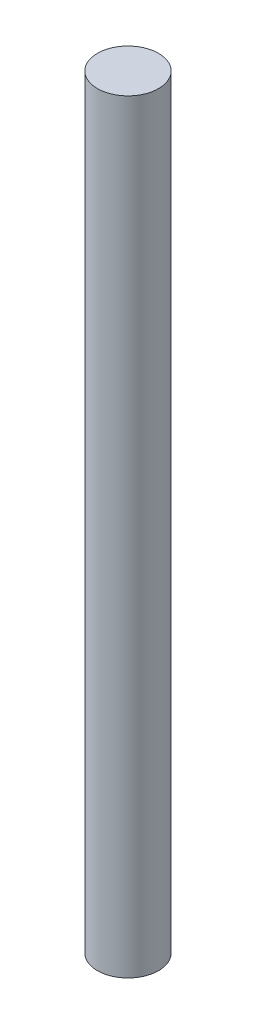
ISO-10303-21;
HEADER;
FILE_DESCRIPTION(('STEP AP214'),'2;1');
FILE_NAME('part.step','',(''),(''),'','','');
FILE_SCHEMA(('AUTOMOTIVE_DESIGN { 1 0 10303 214 1 1 1 1 }'));
ENDSEC;
DATA;
#1=APPLICATION_CONTEXT('core data for automotive mechanical design processes');
#2=APPLICATION_PROTOCOL_DEFINITION('international standard','automotive_design',2000,#1);
#3=PRODUCT_CONTEXT('',#1,'mechanical');
#4=PRODUCT('Part','Part','',(#3));
#5=PRODUCT_RELATED_PRODUCT_CATEGORY('part','',(#4));
#6=PRODUCT_DEFINITION_FORMATION('','',#4);
#7=PRODUCT_DEFINITION_CONTEXT('part definition',#1,'design');
#8=PRODUCT_DEFINITION('design','',#6,#7);
#9=PRODUCT_DEFINITION_SHAPE('','',#8);
#10=(LENGTH_UNIT() NAMED_UNIT(*) SI_UNIT(.MILLI.,.METRE.));
#11=(NAMED_UNIT(*) PLANE_ANGLE_UNIT() SI_UNIT($,.RADIAN.));
#12=(NAMED_UNIT(*) SI_UNIT($,.STERADIAN.) SOLID_ANGLE_UNIT());
#13=UNCERTAINTY_MEASURE_WITH_UNIT(LENGTH_MEASURE(1.E-05),#10,'distance_accuracy_value','');
#14=(GEOMETRIC_REPRESENTATION_CONTEXT(3) GLOBAL_UNCERTAINTY_ASSIGNED_CONTEXT((#13)) GLOBAL_UNIT_ASSIGNED_CONTEXT((#10,
#11,#12)) REPRESENTATION_CONTEXT('',''));
#15=CARTESIAN_POINT('',(0.,0.,0.));
#16=DIRECTION('',(0.,0.,1.));
#17=DIRECTION('',(1.,0.,0.));
#18=AXIS2_PLACEMENT_3D('',#15,#16,#17);
#19=CARTESIAN_POINT('',(0.,100.,0.));
#20=DIRECTION('',(0.,-1.,0.));
#21=DIRECTION('',(0.,0.,-1.));
#22=AXIS2_PLACEMENT_3D('',#19,#20,#21);
#23=CYLINDRICAL_SURFACE('',#22,4.);
#24=CARTESIAN_POINT('',(0.,100.,0.));
#25=DIRECTION('',(0.,1.,0.));
#26=DIRECTION('',(0.,0.,1.));
#27=AXIS2_PLACEMENT_3D('',#24,#25,#26);
#28=CIRCLE('',#27,4.);
#29=CARTESIAN_POINT('',(0.,100.,4.));
#30=VERTEX_POINT('',#29);
#31=EDGE_CURVE('E10',#30,#30,#28,.T.);
#32=ORIENTED_EDGE('',*,*,#31,.F.);
#33=EDGE_LOOP('',(#32));
#34=FACE_BOUND('',#33,.T.);
#35=CARTESIAN_POINT('',(0.,0.,0.));
#36=DIRECTION('',(0.,1.,0.));
#37=DIRECTION('',(0.,0.,1.));
#38=AXIS2_PLACEMENT_3D('',#35,#36,#37);
#39=CIRCLE('',#38,4.);
#40=CARTESIAN_POINT('',(0.,0.,4.));
#41=VERTEX_POINT('',#40);
#42=EDGE_CURVE('E35',#41,#41,#39,.T.);
#43=ORIENTED_EDGE('',*,*,#42,.T.);
#44=EDGE_LOOP('',(#43));
#45=FACE_BOUND('',#44,.T.);
#46=ADVANCED_FACE('F32',(#34,#45),#23,.T.);
#47=CARTESIAN_POINT('',(0.,100.,0.));
#48=DIRECTION('',(0.,1.,0.));
#49=DIRECTION('',(0.,0.,1.));
#50=AXIS2_PLACEMENT_3D('',#47,#48,#49);
#51=PLANE('',#50);
#52=ORIENTED_EDGE('',*,*,#31,.T.);
#53=EDGE_LOOP('',(#52));
#54=FACE_BOUND('',#53,.T.);
#55=ADVANCED_FACE('F47',(#54),#51,.T.);
#56=CARTESIAN_POINT('',(0.,0.,0.));
#57=DIRECTION('',(0.,1.,0.));
#58=DIRECTION('',(0.,0.,1.));
#59=AXIS2_PLACEMENT_3D('',#56,#57,#58);
#60=PLANE('',#59);
#61=ORIENTED_EDGE('',*,*,#42,.F.);
#62=EDGE_LOOP('',(#61));
#63=FACE_BOUND('',#62,.T.);
#64=ADVANCED_FACE('F45',(#63),#60,.F.);
#65=CLOSED_SHELL('',(#46,#55,#64));
#66=MANIFOLD_SOLID_BREP('B2',#65);
#67=ADVANCED_BREP_SHAPE_REPRESENTATION('',(#18,#66),#14);
#68=SHAPE_DEFINITION_REPRESENTATION(#9,#67);
ENDSEC;
END-ISO-10303-21;
